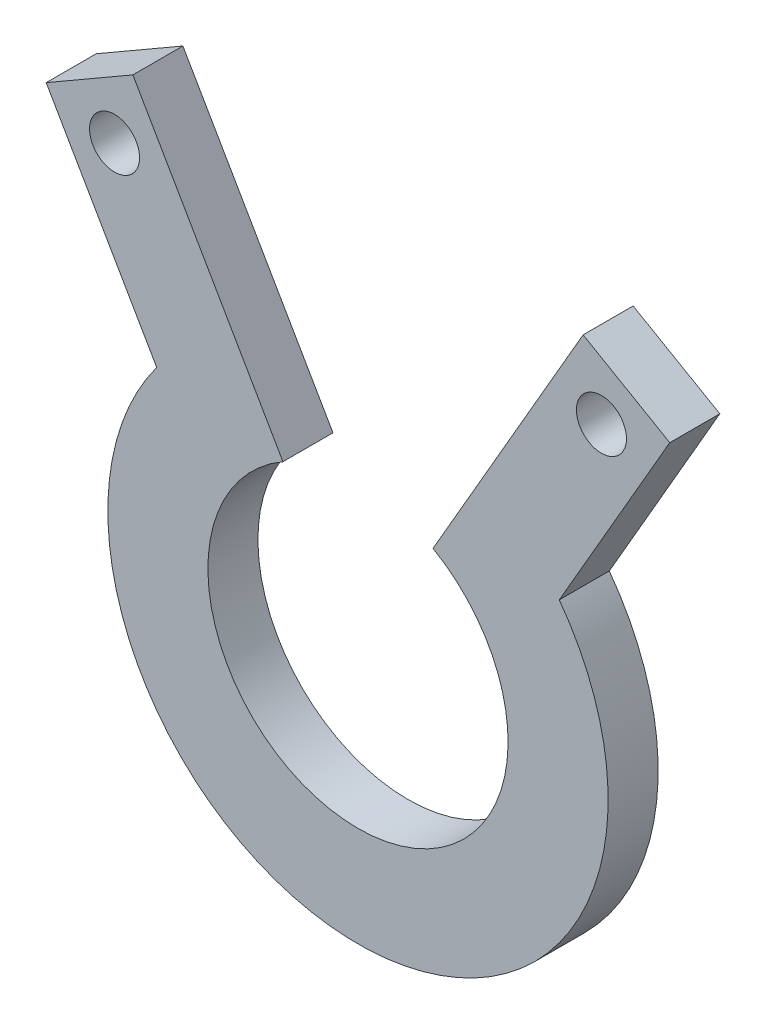
ISO-10303-21;
HEADER;
FILE_DESCRIPTION(('STEP AP214'),'2;1');
FILE_NAME('part.step','',(''),(''),'','','');
FILE_SCHEMA(('AUTOMOTIVE_DESIGN { 1 0 10303 214 1 1 1 1 }'));
ENDSEC;
DATA;
#1=APPLICATION_CONTEXT('core data for automotive mechanical design processes');
#2=APPLICATION_PROTOCOL_DEFINITION('international standard','automotive_design',2000,#1);
#3=PRODUCT_CONTEXT('',#1,'mechanical');
#4=PRODUCT('Part','Part','',(#3));
#5=PRODUCT_RELATED_PRODUCT_CATEGORY('part','',(#4));
#6=PRODUCT_DEFINITION_FORMATION('','',#4);
#7=PRODUCT_DEFINITION_CONTEXT('part definition',#1,'design');
#8=PRODUCT_DEFINITION('design','',#6,#7);
#9=PRODUCT_DEFINITION_SHAPE('','',#8);
#10=(LENGTH_UNIT() NAMED_UNIT(*) SI_UNIT(.MILLI.,.METRE.));
#11=(NAMED_UNIT(*) PLANE_ANGLE_UNIT() SI_UNIT($,.RADIAN.));
#12=(NAMED_UNIT(*) SI_UNIT($,.STERADIAN.) SOLID_ANGLE_UNIT());
#13=UNCERTAINTY_MEASURE_WITH_UNIT(LENGTH_MEASURE(1.E-05),#10,'distance_accuracy_value','');
#14=(GEOMETRIC_REPRESENTATION_CONTEXT(3) GLOBAL_UNCERTAINTY_ASSIGNED_CONTEXT((#13)) GLOBAL_UNIT_ASSIGNED_CONTEXT((#10,
#11,#12)) REPRESENTATION_CONTEXT('',''));
#15=CARTESIAN_POINT('',(0.,0.,0.));
#16=DIRECTION('',(0.,0.,1.));
#17=DIRECTION('',(1.,0.,0.));
#18=AXIS2_PLACEMENT_3D('',#15,#16,#17);
#19=CARTESIAN_POINT('',(0.,0.,3.175));
#20=DIRECTION('',(0.,0.,-1.));
#21=DIRECTION('',(-1.,0.,0.));
#22=AXIS2_PLACEMENT_3D('',#19,#20,#21);
#23=CYLINDRICAL_SURFACE('',#22,15.875);
#24=DIRECTION('',(0.,0.,1.));
#25=VECTOR('',#24,1.);
#26=CARTESIAN_POINT('',(12.7741002297736,9.42539061894507,-19.3687061197778));
#27=LINE('',#26,#25);
#28=CARTESIAN_POINT('',(12.7741002297736,9.42539061894507,0.));
#29=VERTEX_POINT('',#28);
#30=CARTESIAN_POINT('',(12.7741002297736,9.42539061894507,3.175));
#31=VERTEX_POINT('',#30);
#32=EDGE_CURVE('E64',#29,#31,#27,.T.);
#33=ORIENTED_EDGE('',*,*,#32,.T.);
#34=CARTESIAN_POINT('',(0.,0.,3.175));
#35=DIRECTION('',(0.,0.,1.));
#36=DIRECTION('',(1.,0.,0.));
#37=AXIS2_PLACEMENT_3D('',#34,#35,#36);
#38=CIRCLE('',#37,15.875);
#39=CARTESIAN_POINT('',(-12.7741002297736,9.42539061894507,3.175));
#40=VERTEX_POINT('',#39);
#41=EDGE_CURVE('E56',#40,#31,#38,.T.);
#42=ORIENTED_EDGE('',*,*,#41,.F.);
#43=DIRECTION('',(0.,0.,1.));
#44=VECTOR('',#43,1.);
#45=CARTESIAN_POINT('',(-12.7741002297736,9.42539061894507,-19.3687061197778));
#46=LINE('',#45,#44);
#47=CARTESIAN_POINT('',(-12.7741002297736,9.42539061894507,0.));
#48=VERTEX_POINT('',#47);
#49=EDGE_CURVE('E144',#48,#40,#46,.T.);
#50=ORIENTED_EDGE('',*,*,#49,.F.);
#51=CARTESIAN_POINT('',(0.,0.,0.));
#52=DIRECTION('',(0.,0.,1.));
#53=DIRECTION('',(1.,0.,0.));
#54=AXIS2_PLACEMENT_3D('',#51,#52,#53);
#55=CIRCLE('',#54,15.875);
#56=EDGE_CURVE('E69',#48,#29,#55,.T.);
#57=ORIENTED_EDGE('',*,*,#56,.T.);
#58=EDGE_LOOP('',(#33,#42,#50,#57));
#59=FACE_BOUND('',#58,.T.);
#60=ADVANCED_FACE('F48',(#59),#23,.T.);
#61=CARTESIAN_POINT('',(0.,0.,3.175));
#62=DIRECTION('',(0.,0.,-1.));
#63=DIRECTION('',(-1.,0.,0.));
#64=AXIS2_PLACEMENT_3D('',#61,#62,#63);
#65=CYLINDRICAL_SURFACE('',#64,9.525);
#66=DIRECTION('',(0.,0.,-1.));
#67=VECTOR('',#66,1.);
#68=CARTESIAN_POINT('',(4.76250000000002,8.24889197104677,3.175));
#69=LINE('',#68,#67);
#70=CARTESIAN_POINT('',(4.76250000000002,8.24889197104677,0.));
#71=VERTEX_POINT('',#70);
#72=CARTESIAN_POINT('',(4.76250000000002,8.24889197104677,3.175));
#73=VERTEX_POINT('',#72);
#74=EDGE_CURVE('E131',#71,#73,#69,.F.);
#75=ORIENTED_EDGE('',*,*,#74,.F.);
#76=CARTESIAN_POINT('',(0.,0.,0.));
#77=DIRECTION('',(0.,0.,1.));
#78=DIRECTION('',(1.,0.,0.));
#79=AXIS2_PLACEMENT_3D('',#76,#77,#78);
#80=CIRCLE('',#79,9.525);
#81=CARTESIAN_POINT('',(-4.76250000000002,8.24889197104676,0.));
#82=VERTEX_POINT('',#81);
#83=EDGE_CURVE('E51',#82,#71,#80,.T.);
#84=ORIENTED_EDGE('',*,*,#83,.F.);
#85=DIRECTION('',(0.,0.,-1.));
#86=VECTOR('',#85,1.);
#87=CARTESIAN_POINT('',(-4.76250000000002,8.24889197104676,3.175));
#88=LINE('',#87,#86);
#89=CARTESIAN_POINT('',(-4.76250000000002,8.24889197104677,3.175));
#90=VERTEX_POINT('',#89);
#91=EDGE_CURVE('E125',#90,#82,#88,.T.);
#92=ORIENTED_EDGE('',*,*,#91,.F.);
#93=CARTESIAN_POINT('',(0.,0.,3.175));
#94=DIRECTION('',(0.,0.,1.));
#95=DIRECTION('',(1.,0.,0.));
#96=AXIS2_PLACEMENT_3D('',#93,#94,#95);
#97=CIRCLE('',#96,9.525);
#98=EDGE_CURVE('E13',#90,#73,#97,.T.);
#99=ORIENTED_EDGE('',*,*,#98,.T.);
#100=EDGE_LOOP('',(#75,#84,#92,#99));
#101=FACE_BOUND('',#100,.T.);
#102=ADVANCED_FACE('F134',(#101),#65,.F.);
#103=CARTESIAN_POINT('',(0.,0.,3.175));
#104=DIRECTION('',(0.,0.,1.));
#105=DIRECTION('',(1.,0.,0.));
#106=AXIS2_PLACEMENT_3D('',#103,#104,#105);
#107=PLANE('',#106);
#108=DIRECTION('',(-0.500000000000002,-0.866025403784438,0.));
#109=VECTOR('',#108,1.);
#110=CARTESIAN_POINT('',(0.,0.,3.175));
#111=LINE('',#110,#109);
#112=CARTESIAN_POINT('',(14.2875000000001,24.7466759131403,3.175));
#113=VERTEX_POINT('',#112);
#114=EDGE_CURVE('E177',#113,#73,#111,.T.);
#115=ORIENTED_EDGE('',*,*,#114,.T.);
#116=ORIENTED_EDGE('',*,*,#98,.F.);
#117=DIRECTION('',(-0.500000000000001,0.866025403784438,0.));
#118=VECTOR('',#117,1.);
#119=CARTESIAN_POINT('',(0.,0.,3.175));
#120=LINE('',#119,#118);
#121=CARTESIAN_POINT('',(-14.2875000000001,24.7466759131403,3.175));
#122=VERTEX_POINT('',#121);
#123=EDGE_CURVE('E128',#90,#122,#120,.T.);
#124=ORIENTED_EDGE('',*,*,#123,.T.);
#125=DIRECTION('',(-0.866025403784438,-0.500000000000001,0.));
#126=VECTOR('',#125,1.);
#127=CARTESIAN_POINT('',(-14.2875,24.7466759131403,3.175));
#128=LINE('',#127,#126);
#129=CARTESIAN_POINT('',(-19.7867613140312,21.5716759131403,3.175));
#130=VERTEX_POINT('',#129);
#131=EDGE_CURVE('E147',#122,#130,#128,.T.);
#132=ORIENTED_EDGE('',*,*,#131,.T.);
#133=DIRECTION('',(0.500000000000001,-0.866025403784438,0.));
#134=VECTOR('',#133,1.);
#135=CARTESIAN_POINT('',(-5.49926131403121,-3.17500000000002,3.175));
#136=LINE('',#135,#134);
#137=EDGE_CURVE('E157',#130,#40,#136,.T.);
#138=ORIENTED_EDGE('',*,*,#137,.T.);
#139=ORIENTED_EDGE('',*,*,#41,.T.);
#140=DIRECTION('',(-0.500000000000001,-0.866025403784438,0.));
#141=VECTOR('',#140,1.);
#142=CARTESIAN_POINT('',(5.49926131403121,-3.17500000000002,3.175));
#143=LINE('',#142,#141);
#144=CARTESIAN_POINT('',(19.7867613140312,21.5716759131403,3.175));
#145=VERTEX_POINT('',#144);
#146=EDGE_CURVE('E178',#145,#31,#143,.T.);
#147=ORIENTED_EDGE('',*,*,#146,.F.);
#148=DIRECTION('',(0.866025403784438,-0.500000000000001,0.));
#149=VECTOR('',#148,1.);
#150=CARTESIAN_POINT('',(14.2875,24.7466759131403,3.175));
#151=LINE('',#150,#149);
#152=EDGE_CURVE('E170',#113,#145,#151,.T.);
#153=ORIENTED_EDGE('',*,*,#152,.F.);
#154=EDGE_LOOP('',(#115,#116,#124,#132,#138,#139,#147,#153));
#155=FACE_BOUND('',#154,.T.);
#156=CARTESIAN_POINT('',(-15.4496306570157,20.4095452561247,3.175));
#157=DIRECTION('',(0.,0.,1.));
#158=DIRECTION('',(1.,0.,0.));
#159=AXIS2_PLACEMENT_3D('',#156,#157,#158);
#160=CIRCLE('',#159,1.58749999999998);
#161=CARTESIAN_POINT('',(-13.8621306570157,20.4095452561247,3.175));
#162=VERTEX_POINT('',#161);
#163=EDGE_CURVE('E148',#162,#162,#160,.T.);
#164=ORIENTED_EDGE('',*,*,#163,.F.);
#165=EDGE_LOOP('',(#164));
#166=FACE_BOUND('',#165,.T.);
#167=CARTESIAN_POINT('',(15.4496306570157,20.4095452561247,3.175));
#168=DIRECTION('',(0.,0.,1.));
#169=DIRECTION('',(1.,0.,0.));
#170=AXIS2_PLACEMENT_3D('',#167,#168,#169);
#171=CIRCLE('',#170,1.58749999999999);
#172=CARTESIAN_POINT('',(17.0371306570156,20.4095452561247,3.175));
#173=VERTEX_POINT('',#172);
#174=EDGE_CURVE('E164',#173,#173,#171,.F.);
#175=ORIENTED_EDGE('',*,*,#174,.T.);
#176=EDGE_LOOP('',(#175));
#177=FACE_BOUND('',#176,.T.);
#178=ADVANCED_FACE('F192',(#155,#166,#177),#107,.T.);
#179=CARTESIAN_POINT('',(0.,0.,0.));
#180=DIRECTION('',(0.,0.,1.));
#181=DIRECTION('',(1.,0.,0.));
#182=AXIS2_PLACEMENT_3D('',#179,#180,#181);
#183=PLANE('',#182);
#184=ORIENTED_EDGE('',*,*,#83,.T.);
#185=DIRECTION('',(0.500000000000002,0.866025403784437,0.));
#186=VECTOR('',#185,1.);
#187=CARTESIAN_POINT('',(0.,0.,0.));
#188=LINE('',#187,#186);
#189=CARTESIAN_POINT('',(14.2875000000001,24.7466759131403,0.));
#190=VERTEX_POINT('',#189);
#191=EDGE_CURVE('E143',#71,#190,#188,.T.);
#192=ORIENTED_EDGE('',*,*,#191,.T.);
#193=DIRECTION('',(-0.866025403784438,0.500000000000001,0.));
#194=VECTOR('',#193,1.);
#195=CARTESIAN_POINT('',(14.2875,24.7466759131403,0.));
#196=LINE('',#195,#194);
#197=CARTESIAN_POINT('',(19.7867613140312,21.5716759131403,0.));
#198=VERTEX_POINT('',#197);
#199=EDGE_CURVE('E171',#198,#190,#196,.T.);
#200=ORIENTED_EDGE('',*,*,#199,.F.);
#201=DIRECTION('',(0.500000000000001,0.866025403784438,0.));
#202=VECTOR('',#201,1.);
#203=CARTESIAN_POINT('',(5.49926131403121,-3.17500000000002,0.));
#204=LINE('',#203,#202);
#205=EDGE_CURVE('E166',#29,#198,#204,.T.);
#206=ORIENTED_EDGE('',*,*,#205,.F.);
#207=ORIENTED_EDGE('',*,*,#56,.F.);
#208=DIRECTION('',(-0.500000000000001,0.866025403784438,0.));
#209=VECTOR('',#208,1.);
#210=CARTESIAN_POINT('',(-5.49926131403121,-3.17500000000002,0.));
#211=LINE('',#210,#209);
#212=CARTESIAN_POINT('',(-19.7867613140312,21.5716759131403,0.));
#213=VERTEX_POINT('',#212);
#214=EDGE_CURVE('E122',#48,#213,#211,.T.);
#215=ORIENTED_EDGE('',*,*,#214,.T.);
#216=DIRECTION('',(0.866025403784438,0.500000000000001,0.));
#217=VECTOR('',#216,1.);
#218=CARTESIAN_POINT('',(-14.2875,24.7466759131403,0.));
#219=LINE('',#218,#217);
#220=CARTESIAN_POINT('',(-14.2875000000001,24.7466759131403,0.));
#221=VERTEX_POINT('',#220);
#222=EDGE_CURVE('E119',#213,#221,#219,.T.);
#223=ORIENTED_EDGE('',*,*,#222,.T.);
#224=DIRECTION('',(0.500000000000001,-0.866025403784438,0.));
#225=VECTOR('',#224,1.);
#226=CARTESIAN_POINT('',(0.,0.,0.));
#227=LINE('',#226,#225);
#228=EDGE_CURVE('E113',#221,#82,#227,.T.);
#229=ORIENTED_EDGE('',*,*,#228,.T.);
#230=EDGE_LOOP('',(#184,#192,#200,#206,#207,#215,#223,#229));
#231=FACE_BOUND('',#230,.T.);
#232=CARTESIAN_POINT('',(-15.4496306570157,20.4095452561247,0.));
#233=DIRECTION('',(0.,0.,1.));
#234=DIRECTION('',(1.,0.,0.));
#235=AXIS2_PLACEMENT_3D('',#232,#233,#234);
#236=CIRCLE('',#235,1.58749999999998);
#237=CARTESIAN_POINT('',(-13.8621306570157,20.4095452561247,0.));
#238=VERTEX_POINT('',#237);
#239=EDGE_CURVE('E149',#238,#238,#236,.F.);
#240=ORIENTED_EDGE('',*,*,#239,.F.);
#241=EDGE_LOOP('',(#240));
#242=FACE_BOUND('',#241,.T.);
#243=CARTESIAN_POINT('',(15.4496306570157,20.4095452561247,0.));
#244=DIRECTION('',(0.,0.,1.));
#245=DIRECTION('',(1.,0.,0.));
#246=AXIS2_PLACEMENT_3D('',#243,#244,#245);
#247=CIRCLE('',#246,1.58749999999999);
#248=CARTESIAN_POINT('',(17.0371306570156,20.4095452561247,0.));
#249=VERTEX_POINT('',#248);
#250=EDGE_CURVE('E161',#249,#249,#247,.T.);
#251=ORIENTED_EDGE('',*,*,#250,.T.);
#252=EDGE_LOOP('',(#251));
#253=FACE_BOUND('',#252,.T.);
#254=ADVANCED_FACE('F115',(#231,#242,#253),#183,.F.);
#255=CARTESIAN_POINT('',(-14.2875,24.7466759131403,-19.3687061197778));
#256=DIRECTION('',(-0.500000000000001,0.866025403784438,0.));
#257=DIRECTION('',(-0.866025403784438,-0.500000000000001,0.));
#258=AXIS2_PLACEMENT_3D('',#255,#256,#257);
#259=PLANE('',#258);
#260=ORIENTED_EDGE('',*,*,#222,.F.);
#261=DIRECTION('',(0.,0.,1.));
#262=VECTOR('',#261,1.);
#263=CARTESIAN_POINT('',(-19.7867613140312,21.5716759131403,-19.3687061197778));
#264=LINE('',#263,#262);
#265=EDGE_CURVE('E140',#213,#130,#264,.T.);
#266=ORIENTED_EDGE('',*,*,#265,.T.);
#267=ORIENTED_EDGE('',*,*,#131,.F.);
#268=DIRECTION('',(0.,0.,1.));
#269=VECTOR('',#268,1.);
#270=CARTESIAN_POINT('',(-14.2875000000001,24.7466759131403,-19.3687061197778));
#271=LINE('',#270,#269);
#272=EDGE_CURVE('E142',#221,#122,#271,.T.);
#273=ORIENTED_EDGE('',*,*,#272,.F.);
#274=EDGE_LOOP('',(#260,#266,#267,#273));
#275=FACE_BOUND('',#274,.T.);
#276=ADVANCED_FACE('F221',(#275),#259,.T.);
#277=CARTESIAN_POINT('',(0.,0.,-19.3687061197778));
#278=DIRECTION('',(0.866025403784438,0.500000000000001,0.));
#279=DIRECTION('',(-0.500000000000001,0.866025403784438,0.));
#280=AXIS2_PLACEMENT_3D('',#277,#278,#279);
#281=PLANE('',#280);
#282=ORIENTED_EDGE('',*,*,#228,.F.);
#283=ORIENTED_EDGE('',*,*,#272,.T.);
#284=ORIENTED_EDGE('',*,*,#123,.F.);
#285=ORIENTED_EDGE('',*,*,#91,.T.);
#286=EDGE_LOOP('',(#282,#283,#284,#285));
#287=FACE_BOUND('',#286,.T.);
#288=ADVANCED_FACE('F126',(#287),#281,.T.);
#289=CARTESIAN_POINT('',(-15.4496306570157,20.4095452561247,-19.3687061197778));
#290=DIRECTION('',(0.,0.,1.));
#291=DIRECTION('',(1.,0.,0.));
#292=AXIS2_PLACEMENT_3D('',#289,#290,#291);
#293=CYLINDRICAL_SURFACE('',#292,1.58749999999998);
#294=ORIENTED_EDGE('',*,*,#239,.T.);
#295=EDGE_LOOP('',(#294));
#296=FACE_BOUND('',#295,.T.);
#297=ORIENTED_EDGE('',*,*,#163,.T.);
#298=EDGE_LOOP('',(#297));
#299=FACE_BOUND('',#298,.T.);
#300=ADVANCED_FACE('F228',(#296,#299),#293,.F.);
#301=CARTESIAN_POINT('',(-5.49926131403121,-3.17500000000002,-19.3687061197778));
#302=DIRECTION('',(-0.866025403784438,-0.500000000000001,0.));
#303=DIRECTION('',(0.500000000000001,-0.866025403784438,0.));
#304=AXIS2_PLACEMENT_3D('',#301,#302,#303);
#305=PLANE('',#304);
#306=ORIENTED_EDGE('',*,*,#214,.F.);
#307=ORIENTED_EDGE('',*,*,#49,.T.);
#308=ORIENTED_EDGE('',*,*,#137,.F.);
#309=ORIENTED_EDGE('',*,*,#265,.F.);
#310=EDGE_LOOP('',(#306,#307,#308,#309));
#311=FACE_BOUND('',#310,.T.);
#312=ADVANCED_FACE('F209',(#311),#305,.T.);
#313=CARTESIAN_POINT('',(14.2875,24.7466759131403,-19.3687061197778));
#314=DIRECTION('',(-0.500000000000001,-0.866025403784438,0.));
#315=DIRECTION('',(0.866025403784438,-0.500000000000001,0.));
#316=AXIS2_PLACEMENT_3D('',#313,#314,#315);
#317=PLANE('',#316);
#318=DIRECTION('',(0.,0.,1.));
#319=VECTOR('',#318,1.);
#320=CARTESIAN_POINT('',(19.7867613140312,21.5716759131403,-19.3687061197778));
#321=LINE('',#320,#319);
#322=EDGE_CURVE('E169',#198,#145,#321,.T.);
#323=ORIENTED_EDGE('',*,*,#322,.F.);
#324=ORIENTED_EDGE('',*,*,#199,.T.);
#325=DIRECTION('',(0.,0.,1.));
#326=VECTOR('',#325,1.);
#327=CARTESIAN_POINT('',(14.2875000000001,24.7466759131403,-19.3687061197778));
#328=LINE('',#327,#326);
#329=EDGE_CURVE('E174',#190,#113,#328,.T.);
#330=ORIENTED_EDGE('',*,*,#329,.T.);
#331=ORIENTED_EDGE('',*,*,#152,.T.);
#332=EDGE_LOOP('',(#323,#324,#330,#331));
#333=FACE_BOUND('',#332,.T.);
#334=ADVANCED_FACE('F198',(#333),#317,.F.);
#335=CARTESIAN_POINT('',(5.49926131403121,-3.17500000000002,-19.3687061197778));
#336=DIRECTION('',(-0.866025403784438,0.500000000000001,0.));
#337=DIRECTION('',(-0.500000000000001,-0.866025403784438,0.));
#338=AXIS2_PLACEMENT_3D('',#335,#336,#337);
#339=PLANE('',#338);
#340=ORIENTED_EDGE('',*,*,#32,.F.);
#341=ORIENTED_EDGE('',*,*,#205,.T.);
#342=ORIENTED_EDGE('',*,*,#322,.T.);
#343=ORIENTED_EDGE('',*,*,#146,.T.);
#344=EDGE_LOOP('',(#340,#341,#342,#343));
#345=FACE_BOUND('',#344,.T.);
#346=ADVANCED_FACE('F200',(#345),#339,.F.);
#347=CARTESIAN_POINT('',(0.,0.,-19.3687061197778));
#348=DIRECTION('',(-0.866025403784437,0.500000000000002,0.));
#349=DIRECTION('',(-0.500000000000002,-0.866025403784437,0.));
#350=AXIS2_PLACEMENT_3D('',#347,#348,#349);
#351=PLANE('',#350);
#352=ORIENTED_EDGE('',*,*,#191,.F.);
#353=ORIENTED_EDGE('',*,*,#74,.T.);
#354=ORIENTED_EDGE('',*,*,#114,.F.);
#355=ORIENTED_EDGE('',*,*,#329,.F.);
#356=EDGE_LOOP('',(#352,#353,#354,#355));
#357=FACE_BOUND('',#356,.T.);
#358=ADVANCED_FACE('F189',(#357),#351,.T.);
#359=CARTESIAN_POINT('',(15.4496306570157,20.4095452561247,-19.3687061197778));
#360=DIRECTION('',(0.,0.,1.));
#361=DIRECTION('',(1.,0.,0.));
#362=AXIS2_PLACEMENT_3D('',#359,#360,#361);
#363=CYLINDRICAL_SURFACE('',#362,1.58749999999999);
#364=ORIENTED_EDGE('',*,*,#250,.F.);
#365=EDGE_LOOP('',(#364));
#366=FACE_BOUND('',#365,.T.);
#367=ORIENTED_EDGE('',*,*,#174,.F.);
#368=EDGE_LOOP('',(#367));
#369=FACE_BOUND('',#368,.T.);
#370=ADVANCED_FACE('F207',(#366,#369),#363,.F.);
#371=CLOSED_SHELL('',(#60,#102,#178,#254,#276,#288,#300,#312,#334,#346,#358,#370));
#372=MANIFOLD_SOLID_BREP('B2',#371);
#373=ADVANCED_BREP_SHAPE_REPRESENTATION('',(#18,#372),#14);
#374=SHAPE_DEFINITION_REPRESENTATION(#9,#373);
ENDSEC;
END-ISO-10303-21;
